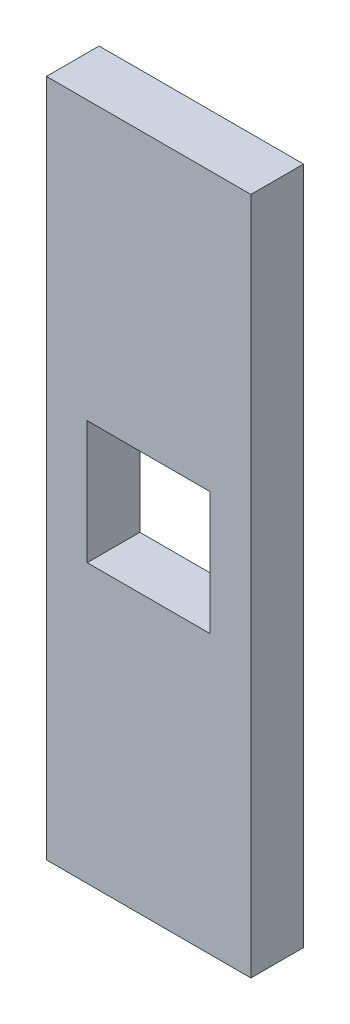
ISO-10303-21;
HEADER;
FILE_DESCRIPTION(('STEP AP214'),'2;1');
FILE_NAME('part.step','',(''),(''),'','','');
FILE_SCHEMA(('AUTOMOTIVE_DESIGN { 1 0 10303 214 1 1 1 1 }'));
ENDSEC;
DATA;
#1=APPLICATION_CONTEXT('core data for automotive mechanical design processes');
#2=APPLICATION_PROTOCOL_DEFINITION('international standard','automotive_design',2000,#1);
#3=PRODUCT_CONTEXT('',#1,'mechanical');
#4=PRODUCT('Part','Part','',(#3));
#5=PRODUCT_RELATED_PRODUCT_CATEGORY('part','',(#4));
#6=PRODUCT_DEFINITION_FORMATION('','',#4);
#7=PRODUCT_DEFINITION_CONTEXT('part definition',#1,'design');
#8=PRODUCT_DEFINITION('design','',#6,#7);
#9=PRODUCT_DEFINITION_SHAPE('','',#8);
#10=(LENGTH_UNIT() NAMED_UNIT(*) SI_UNIT(.MILLI.,.METRE.));
#11=(NAMED_UNIT(*) PLANE_ANGLE_UNIT() SI_UNIT($,.RADIAN.));
#12=(NAMED_UNIT(*) SI_UNIT($,.STERADIAN.) SOLID_ANGLE_UNIT());
#13=UNCERTAINTY_MEASURE_WITH_UNIT(LENGTH_MEASURE(1.E-05),#10,'distance_accuracy_value','');
#14=(GEOMETRIC_REPRESENTATION_CONTEXT(3) GLOBAL_UNCERTAINTY_ASSIGNED_CONTEXT((#13)) GLOBAL_UNIT_ASSIGNED_CONTEXT((#10,
#11,#12)) REPRESENTATION_CONTEXT('',''));
#15=CARTESIAN_POINT('',(0.,0.,0.));
#16=DIRECTION('',(0.,0.,1.));
#17=DIRECTION('',(1.,0.,0.));
#18=AXIS2_PLACEMENT_3D('',#15,#16,#17);
#19=CARTESIAN_POINT('',(0.,0.,5.2));
#20=DIRECTION('',(0.,0.,-1.));
#21=DIRECTION('',(-1.,0.,0.));
#22=AXIS2_PLACEMENT_3D('',#19,#20,#21);
#23=PLANE('',#22);
#24=DIRECTION('',(0.,-1.,0.));
#25=VECTOR('',#24,1.);
#26=CARTESIAN_POINT('',(-0.100000000000003,66.95,5.2));
#27=LINE('',#26,#25);
#28=CARTESIAN_POINT('',(-0.100000000000003,66.95,5.2));
#29=VERTEX_POINT('',#28);
#30=CARTESIAN_POINT('',(-0.0999999999999994,-0.100000000000003,5.2));
#31=VERTEX_POINT('',#30);
#32=EDGE_CURVE('E134',#29,#31,#27,.T.);
#33=ORIENTED_EDGE('',*,*,#32,.T.);
#34=DIRECTION('',(1.,0.,0.));
#35=VECTOR('',#34,1.);
#36=CARTESIAN_POINT('',(20.1,-0.100000000000003,5.2));
#37=LINE('',#36,#35);
#38=CARTESIAN_POINT('',(20.1,-0.100000000000003,5.2));
#39=VERTEX_POINT('',#38);
#40=EDGE_CURVE('E136',#31,#39,#37,.T.);
#41=ORIENTED_EDGE('',*,*,#40,.T.);
#42=DIRECTION('',(0.,1.,0.));
#43=VECTOR('',#42,1.);
#44=CARTESIAN_POINT('',(20.1,22.3,5.2));
#45=LINE('',#44,#43);
#46=CARTESIAN_POINT('',(20.1,66.95,5.2));
#47=VERTEX_POINT('',#46);
#48=EDGE_CURVE('E139',#39,#47,#45,.T.);
#49=ORIENTED_EDGE('',*,*,#48,.T.);
#50=DIRECTION('',(-1.,0.,0.));
#51=VECTOR('',#50,1.);
#52=CARTESIAN_POINT('',(-0.100000000000003,66.95,5.2));
#53=LINE('',#52,#51);
#54=EDGE_CURVE('E141',#47,#29,#53,.T.);
#55=ORIENTED_EDGE('',*,*,#54,.T.);
#56=EDGE_LOOP('',(#33,#41,#49,#55));
#57=FACE_BOUND('',#56,.T.);
#58=DIRECTION('',(0.,-1.,0.));
#59=VECTOR('',#58,1.);
#60=CARTESIAN_POINT('',(3.925,39.5,5.2));
#61=LINE('',#60,#59);
#62=CARTESIAN_POINT('',(3.925,39.5,5.2));
#63=VERTEX_POINT('',#62);
#64=CARTESIAN_POINT('',(3.925,27.35,5.2));
#65=VERTEX_POINT('',#64);
#66=EDGE_CURVE('E98',#63,#65,#61,.T.);
#67=ORIENTED_EDGE('',*,*,#66,.F.);
#68=DIRECTION('',(-1.,0.,0.));
#69=VECTOR('',#68,1.);
#70=CARTESIAN_POINT('',(3.925,39.5,5.2));
#71=LINE('',#70,#69);
#72=CARTESIAN_POINT('',(16.075,39.5,5.2));
#73=VERTEX_POINT('',#72);
#74=EDGE_CURVE('E120',#73,#63,#71,.T.);
#75=ORIENTED_EDGE('',*,*,#74,.F.);
#76=DIRECTION('',(0.,1.,0.));
#77=VECTOR('',#76,1.);
#78=CARTESIAN_POINT('',(16.075,39.5,5.2));
#79=LINE('',#78,#77);
#80=CARTESIAN_POINT('',(16.075,27.35,5.2));
#81=VERTEX_POINT('',#80);
#82=EDGE_CURVE('E118',#81,#73,#79,.T.);
#83=ORIENTED_EDGE('',*,*,#82,.F.);
#84=DIRECTION('',(1.,0.,0.));
#85=VECTOR('',#84,1.);
#86=CARTESIAN_POINT('',(3.925,27.35,5.2));
#87=LINE('',#86,#85);
#88=EDGE_CURVE('E106',#65,#81,#87,.T.);
#89=ORIENTED_EDGE('',*,*,#88,.F.);
#90=EDGE_LOOP('',(#67,#75,#83,#89));
#91=FACE_BOUND('',#90,.T.);
#92=ADVANCED_FACE('F33',(#57,#91),#23,.F.);
#93=CARTESIAN_POINT('',(0.,0.,0.));
#94=DIRECTION('',(0.,0.,-1.));
#95=DIRECTION('',(-1.,0.,0.));
#96=AXIS2_PLACEMENT_3D('',#93,#94,#95);
#97=PLANE('',#96);
#98=DIRECTION('',(0.,-1.,0.));
#99=VECTOR('',#98,1.);
#100=CARTESIAN_POINT('',(-0.0999999999999994,22.3,0.));
#101=LINE('',#100,#99);
#102=CARTESIAN_POINT('',(-0.100000000000003,66.95,0.));
#103=VERTEX_POINT('',#102);
#104=CARTESIAN_POINT('',(-0.0999999999999994,-0.100000000000003,0.));
#105=VERTEX_POINT('',#104);
#106=EDGE_CURVE('E114',#103,#105,#101,.T.);
#107=ORIENTED_EDGE('',*,*,#106,.F.);
#108=DIRECTION('',(-1.,0.,0.));
#109=VECTOR('',#108,1.);
#110=CARTESIAN_POINT('',(-0.100000000000003,66.95,0.));
#111=LINE('',#110,#109);
#112=CARTESIAN_POINT('',(20.1,66.95,0.));
#113=VERTEX_POINT('',#112);
#114=EDGE_CURVE('E137',#113,#103,#111,.T.);
#115=ORIENTED_EDGE('',*,*,#114,.F.);
#116=DIRECTION('',(0.,1.,0.));
#117=VECTOR('',#116,1.);
#118=CARTESIAN_POINT('',(20.1,66.95,0.));
#119=LINE('',#118,#117);
#120=CARTESIAN_POINT('',(20.1,-0.100000000000003,0.));
#121=VERTEX_POINT('',#120);
#122=EDGE_CURVE('E148',#121,#113,#119,.T.);
#123=ORIENTED_EDGE('',*,*,#122,.F.);
#124=DIRECTION('',(1.,0.,0.));
#125=VECTOR('',#124,1.);
#126=CARTESIAN_POINT('',(20.1,-0.100000000000003,0.));
#127=LINE('',#126,#125);
#128=EDGE_CURVE('E145',#105,#121,#127,.T.);
#129=ORIENTED_EDGE('',*,*,#128,.F.);
#130=EDGE_LOOP('',(#107,#115,#123,#129));
#131=FACE_BOUND('',#130,.T.);
#132=DIRECTION('',(-1.,0.,0.));
#133=VECTOR('',#132,1.);
#134=CARTESIAN_POINT('',(3.925,39.5,0.));
#135=LINE('',#134,#133);
#136=CARTESIAN_POINT('',(16.075,39.5,0.));
#137=VERTEX_POINT('',#136);
#138=CARTESIAN_POINT('',(3.925,39.5,0.));
#139=VERTEX_POINT('',#138);
#140=EDGE_CURVE('E107',#137,#139,#135,.T.);
#141=ORIENTED_EDGE('',*,*,#140,.T.);
#142=DIRECTION('',(0.,-1.,0.));
#143=VECTOR('',#142,1.);
#144=CARTESIAN_POINT('',(3.925,39.5,0.));
#145=LINE('',#144,#143);
#146=CARTESIAN_POINT('',(3.925,27.35,0.));
#147=VERTEX_POINT('',#146);
#148=EDGE_CURVE('E56',#139,#147,#145,.T.);
#149=ORIENTED_EDGE('',*,*,#148,.T.);
#150=DIRECTION('',(1.,0.,0.));
#151=VECTOR('',#150,1.);
#152=CARTESIAN_POINT('',(3.925,27.35,0.));
#153=LINE('',#152,#151);
#154=CARTESIAN_POINT('',(16.075,27.35,0.));
#155=VERTEX_POINT('',#154);
#156=EDGE_CURVE('E113',#147,#155,#153,.T.);
#157=ORIENTED_EDGE('',*,*,#156,.T.);
#158=DIRECTION('',(0.,1.,0.));
#159=VECTOR('',#158,1.);
#160=CARTESIAN_POINT('',(16.075,39.5,0.));
#161=LINE('',#160,#159);
#162=EDGE_CURVE('E126',#155,#137,#161,.T.);
#163=ORIENTED_EDGE('',*,*,#162,.T.);
#164=EDGE_LOOP('',(#141,#149,#157,#163));
#165=FACE_BOUND('',#164,.T.);
#166=ADVANCED_FACE('F168',(#131,#165),#97,.T.);
#167=CARTESIAN_POINT('',(-0.0999999999999994,22.3,5.2));
#168=DIRECTION('',(1.,0.,0.));
#169=DIRECTION('',(0.,0.,-1.));
#170=AXIS2_PLACEMENT_3D('',#167,#168,#169);
#171=PLANE('',#170);
#172=ORIENTED_EDGE('',*,*,#106,.T.);
#173=DIRECTION('',(0.,0.,-1.));
#174=VECTOR('',#173,1.);
#175=CARTESIAN_POINT('',(-0.0999999999999994,-0.100000000000003,5.2));
#176=LINE('',#175,#174);
#177=EDGE_CURVE('E11',#31,#105,#176,.T.);
#178=ORIENTED_EDGE('',*,*,#177,.F.);
#179=ORIENTED_EDGE('',*,*,#32,.F.);
#180=DIRECTION('',(0.,0.,-1.));
#181=VECTOR('',#180,1.);
#182=CARTESIAN_POINT('',(-0.100000000000003,66.95,5.2));
#183=LINE('',#182,#181);
#184=EDGE_CURVE('E143',#29,#103,#183,.T.);
#185=ORIENTED_EDGE('',*,*,#184,.T.);
#186=EDGE_LOOP('',(#172,#178,#179,#185));
#187=FACE_BOUND('',#186,.T.);
#188=ADVANCED_FACE('F35',(#187),#171,.F.);
#189=CARTESIAN_POINT('',(20.1,-0.100000000000003,5.2));
#190=DIRECTION('',(0.,1.,0.));
#191=DIRECTION('',(-1.,0.,0.));
#192=AXIS2_PLACEMENT_3D('',#189,#190,#191);
#193=PLANE('',#192);
#194=ORIENTED_EDGE('',*,*,#128,.T.);
#195=DIRECTION('',(0.,0.,-1.));
#196=VECTOR('',#195,1.);
#197=CARTESIAN_POINT('',(20.1,-0.100000000000003,5.2));
#198=LINE('',#197,#196);
#199=EDGE_CURVE('E41',#39,#121,#198,.T.);
#200=ORIENTED_EDGE('',*,*,#199,.F.);
#201=ORIENTED_EDGE('',*,*,#40,.F.);
#202=ORIENTED_EDGE('',*,*,#177,.T.);
#203=EDGE_LOOP('',(#194,#200,#201,#202));
#204=FACE_BOUND('',#203,.T.);
#205=ADVANCED_FACE('F164',(#204),#193,.F.);
#206=CARTESIAN_POINT('',(20.1,66.95,5.2));
#207=DIRECTION('',(-1.,0.,0.));
#208=DIRECTION('',(0.,0.,1.));
#209=AXIS2_PLACEMENT_3D('',#206,#207,#208);
#210=PLANE('',#209);
#211=ORIENTED_EDGE('',*,*,#122,.T.);
#212=DIRECTION('',(0.,0.,-1.));
#213=VECTOR('',#212,1.);
#214=CARTESIAN_POINT('',(20.1,66.95,5.2));
#215=LINE('',#214,#213);
#216=EDGE_CURVE('E154',#47,#113,#215,.T.);
#217=ORIENTED_EDGE('',*,*,#216,.F.);
#218=ORIENTED_EDGE('',*,*,#48,.F.);
#219=ORIENTED_EDGE('',*,*,#199,.T.);
#220=EDGE_LOOP('',(#211,#217,#218,#219));
#221=FACE_BOUND('',#220,.T.);
#222=ADVANCED_FACE('F160',(#221),#210,.F.);
#223=CARTESIAN_POINT('',(-0.100000000000003,66.95,5.2));
#224=DIRECTION('',(0.,-1.,0.));
#225=DIRECTION('',(0.,0.,-1.));
#226=AXIS2_PLACEMENT_3D('',#223,#224,#225);
#227=PLANE('',#226);
#228=ORIENTED_EDGE('',*,*,#114,.T.);
#229=ORIENTED_EDGE('',*,*,#184,.F.);
#230=ORIENTED_EDGE('',*,*,#54,.F.);
#231=ORIENTED_EDGE('',*,*,#216,.T.);
#232=EDGE_LOOP('',(#228,#229,#230,#231));
#233=FACE_BOUND('',#232,.T.);
#234=ADVANCED_FACE('F173',(#233),#227,.F.);
#235=CARTESIAN_POINT('',(3.925,39.5,5.2));
#236=DIRECTION('',(1.,0.,0.));
#237=DIRECTION('',(0.,0.,-1.));
#238=AXIS2_PLACEMENT_3D('',#235,#236,#237);
#239=PLANE('',#238);
#240=ORIENTED_EDGE('',*,*,#148,.F.);
#241=DIRECTION('',(0.,0.,-1.));
#242=VECTOR('',#241,1.);
#243=CARTESIAN_POINT('',(3.925,39.5,5.2));
#244=LINE('',#243,#242);
#245=EDGE_CURVE('E102',#63,#139,#244,.T.);
#246=ORIENTED_EDGE('',*,*,#245,.F.);
#247=ORIENTED_EDGE('',*,*,#66,.T.);
#248=DIRECTION('',(0.,0.,-1.));
#249=VECTOR('',#248,1.);
#250=CARTESIAN_POINT('',(3.925,27.35,5.2));
#251=LINE('',#250,#249);
#252=EDGE_CURVE('E101',#65,#147,#251,.T.);
#253=ORIENTED_EDGE('',*,*,#252,.T.);
#254=EDGE_LOOP('',(#240,#246,#247,#253));
#255=FACE_BOUND('',#254,.T.);
#256=ADVANCED_FACE('F100',(#255),#239,.T.);
#257=CARTESIAN_POINT('',(3.925,27.35,5.2));
#258=DIRECTION('',(0.,1.,0.));
#259=DIRECTION('',(0.,0.,1.));
#260=AXIS2_PLACEMENT_3D('',#257,#258,#259);
#261=PLANE('',#260);
#262=ORIENTED_EDGE('',*,*,#156,.F.);
#263=ORIENTED_EDGE('',*,*,#252,.F.);
#264=ORIENTED_EDGE('',*,*,#88,.T.);
#265=DIRECTION('',(0.,0.,-1.));
#266=VECTOR('',#265,1.);
#267=CARTESIAN_POINT('',(16.075,27.35,5.2));
#268=LINE('',#267,#266);
#269=EDGE_CURVE('E115',#81,#155,#268,.T.);
#270=ORIENTED_EDGE('',*,*,#269,.T.);
#271=EDGE_LOOP('',(#262,#263,#264,#270));
#272=FACE_BOUND('',#271,.T.);
#273=ADVANCED_FACE('F110',(#272),#261,.T.);
#274=CARTESIAN_POINT('',(16.075,39.5,5.2));
#275=DIRECTION('',(-1.,0.,0.));
#276=DIRECTION('',(0.,0.,1.));
#277=AXIS2_PLACEMENT_3D('',#274,#275,#276);
#278=PLANE('',#277);
#279=ORIENTED_EDGE('',*,*,#162,.F.);
#280=ORIENTED_EDGE('',*,*,#269,.F.);
#281=ORIENTED_EDGE('',*,*,#82,.T.);
#282=DIRECTION('',(0.,0.,-1.));
#283=VECTOR('',#282,1.);
#284=CARTESIAN_POINT('',(16.075,39.5,5.2));
#285=LINE('',#284,#283);
#286=EDGE_CURVE('E48',#73,#137,#285,.T.);
#287=ORIENTED_EDGE('',*,*,#286,.T.);
#288=EDGE_LOOP('',(#279,#280,#281,#287));
#289=FACE_BOUND('',#288,.T.);
#290=ADVANCED_FACE('F260',(#289),#278,.T.);
#291=CARTESIAN_POINT('',(3.925,39.5,5.2));
#292=DIRECTION('',(0.,-1.,0.));
#293=DIRECTION('',(0.,0.,-1.));
#294=AXIS2_PLACEMENT_3D('',#291,#292,#293);
#295=PLANE('',#294);
#296=ORIENTED_EDGE('',*,*,#140,.F.);
#297=ORIENTED_EDGE('',*,*,#286,.F.);
#298=ORIENTED_EDGE('',*,*,#74,.T.);
#299=ORIENTED_EDGE('',*,*,#245,.T.);
#300=EDGE_LOOP('',(#296,#297,#298,#299));
#301=FACE_BOUND('',#300,.T.);
#302=ADVANCED_FACE('F267',(#301),#295,.T.);
#303=CLOSED_SHELL('',(#92,#166,#188,#205,#222,#234,#256,#273,#290,#302));
#304=MANIFOLD_SOLID_BREP('B2',#303);
#305=ADVANCED_BREP_SHAPE_REPRESENTATION('',(#18,#304),#14);
#306=SHAPE_DEFINITION_REPRESENTATION(#9,#305);
ENDSEC;
END-ISO-10303-21;
